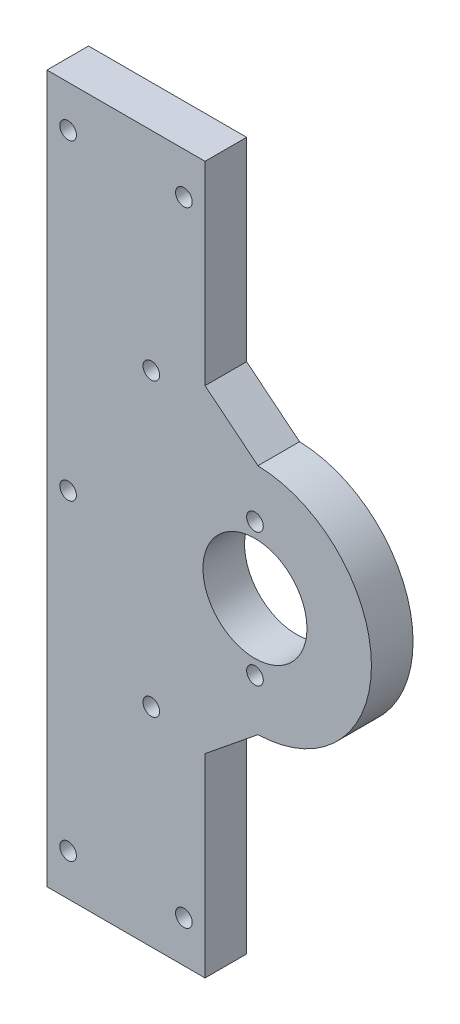
ISO-10303-21;
HEADER;
FILE_DESCRIPTION(('STEP AP214'),'2;1');
FILE_NAME('part.step','',(''),(''),'','','');
FILE_SCHEMA(('AUTOMOTIVE_DESIGN { 1 0 10303 214 1 1 1 1 }'));
ENDSEC;
DATA;
#1=APPLICATION_CONTEXT('core data for automotive mechanical design processes');
#2=APPLICATION_PROTOCOL_DEFINITION('international standard','automotive_design',2000,#1);
#3=PRODUCT_CONTEXT('',#1,'mechanical');
#4=PRODUCT('Part','Part','',(#3));
#5=PRODUCT_RELATED_PRODUCT_CATEGORY('part','',(#4));
#6=PRODUCT_DEFINITION_FORMATION('','',#4);
#7=PRODUCT_DEFINITION_CONTEXT('part definition',#1,'design');
#8=PRODUCT_DEFINITION('design','',#6,#7);
#9=PRODUCT_DEFINITION_SHAPE('','',#8);
#10=(LENGTH_UNIT() NAMED_UNIT(*) SI_UNIT(.MILLI.,.METRE.));
#11=(NAMED_UNIT(*) PLANE_ANGLE_UNIT() SI_UNIT($,.RADIAN.));
#12=(NAMED_UNIT(*) SI_UNIT($,.STERADIAN.) SOLID_ANGLE_UNIT());
#13=UNCERTAINTY_MEASURE_WITH_UNIT(LENGTH_MEASURE(1.E-05),#10,'distance_accuracy_value','');
#14=(GEOMETRIC_REPRESENTATION_CONTEXT(3) GLOBAL_UNCERTAINTY_ASSIGNED_CONTEXT((#13)) GLOBAL_UNIT_ASSIGNED_CONTEXT((#10,
#11,#12)) REPRESENTATION_CONTEXT('',''));
#15=CARTESIAN_POINT('',(0.,0.,0.));
#16=DIRECTION('',(0.,0.,1.));
#17=DIRECTION('',(1.,0.,0.));
#18=AXIS2_PLACEMENT_3D('',#15,#16,#17);
#19=CARTESIAN_POINT('',(11.0000287241917,0.000305589545769956,10.));
#20=DIRECTION('',(0.,0.,1.));
#21=DIRECTION('',(1.,0.,0.));
#22=AXIS2_PLACEMENT_3D('',#19,#20,#21);
#23=PLANE('',#22);
#24=CARTESIAN_POINT('',(11.0000287241921,16.0003055895463,10.));
#25=DIRECTION('',(0.,0.,1.));
#26=DIRECTION('',(1.,0.,0.));
#27=AXIS2_PLACEMENT_3D('',#24,#25,#26);
#28=CIRCLE('',#27,2.);
#29=CARTESIAN_POINT('',(13.0000287241921,16.0003055895463,10.));
#30=VERTEX_POINT('',#29);
#31=EDGE_CURVE('E224',#30,#30,#28,.T.);
#32=ORIENTED_EDGE('',*,*,#31,.F.);
#33=EDGE_LOOP('',(#32));
#34=FACE_BOUND('',#33,.T.);
#35=CARTESIAN_POINT('',(-33.9162598292717,0.,10.));
#36=DIRECTION('',(0.,0.,1.));
#37=DIRECTION('',(1.,0.,0.));
#38=AXIS2_PLACEMENT_3D('',#35,#36,#37);
#39=CIRCLE('',#38,2.);
#40=CARTESIAN_POINT('',(-31.9162598292717,0.,10.));
#41=VERTEX_POINT('',#40);
#42=EDGE_CURVE('E212',#41,#41,#39,.T.);
#43=ORIENTED_EDGE('',*,*,#42,.F.);
#44=EDGE_LOOP('',(#43));
#45=FACE_BOUND('',#44,.T.);
#46=CARTESIAN_POINT('',(-6.08379761911191,-75.,10.));
#47=DIRECTION('',(0.,0.,1.));
#48=DIRECTION('',(1.,0.,0.));
#49=AXIS2_PLACEMENT_3D('',#46,#47,#48);
#50=CIRCLE('',#49,2.);
#51=CARTESIAN_POINT('',(-4.08379761911191,-75.,10.));
#52=VERTEX_POINT('',#51);
#53=EDGE_CURVE('E200',#52,#52,#50,.T.);
#54=ORIENTED_EDGE('',*,*,#53,.F.);
#55=EDGE_LOOP('',(#54));
#56=FACE_BOUND('',#55,.T.);
#57=CARTESIAN_POINT('',(11.0000287241917,0.000305589545769956,10.));
#58=DIRECTION('',(0.,0.,1.));
#59=DIRECTION('',(1.,0.,0.));
#60=AXIS2_PLACEMENT_3D('',#57,#58,#59);
#61=CIRCLE('',#60,12.5);
#62=CARTESIAN_POINT('',(23.5000287241917,0.000305589545769956,10.));
#63=VERTEX_POINT('',#62);
#64=EDGE_CURVE('E188',#63,#63,#61,.T.);
#65=ORIENTED_EDGE('',*,*,#64,.F.);
#66=EDGE_LOOP('',(#65));
#67=FACE_BOUND('',#66,.T.);
#68=CARTESIAN_POINT('',(-13.9162598292717,-35.,10.));
#69=DIRECTION('',(0.,0.,1.));
#70=DIRECTION('',(1.,0.,0.));
#71=AXIS2_PLACEMENT_3D('',#68,#69,#70);
#72=CIRCLE('',#71,2.);
#73=CARTESIAN_POINT('',(-11.9162598292717,-35.,10.));
#74=VERTEX_POINT('',#73);
#75=EDGE_CURVE('E134',#74,#74,#72,.T.);
#76=ORIENTED_EDGE('',*,*,#75,.F.);
#77=EDGE_LOOP('',(#76));
#78=FACE_BOUND('',#77,.T.);
#79=DIRECTION('',(0.,1.,0.));
#80=VECTOR('',#79,1.);
#81=CARTESIAN_POINT('',(-1.00002872419179,-85.,10.));
#82=LINE('',#81,#80);
#83=CARTESIAN_POINT('',(-1.00002872419179,-85.,10.));
#84=VERTEX_POINT('',#83);
#85=CARTESIAN_POINT('',(-1.00002872419179,-38.2978884415605,10.));
#86=VERTEX_POINT('',#85);
#87=EDGE_CURVE('E145',#84,#86,#82,.T.);
#88=ORIENTED_EDGE('',*,*,#87,.T.);
#89=DIRECTION('',(0.776892174709221,0.629633662438387,0.));
#90=VECTOR('',#89,1.);
#91=CARTESIAN_POINT('',(-1.00002872419179,-38.2978884415605,10.));
#92=LINE('',#91,#90);
#93=CARTESIAN_POINT('',(11.7180653731377,-27.9904861707952,10.));
#94=VERTEX_POINT('',#93);
#95=EDGE_CURVE('E93',#86,#94,#92,.T.);
#96=ORIENTED_EDGE('',*,*,#95,.T.);
#97=CARTESIAN_POINT('',(11.0000287241917,0.000305589545769956,10.));
#98=DIRECTION('',(0.,0.,1.));
#99=DIRECTION('',(1.,0.,0.));
#100=AXIS2_PLACEMENT_3D('',#97,#98,#99);
#101=CIRCLE('',#100,28.);
#102=CARTESIAN_POINT('',(11.7180653731377,27.9910973498867,10.));
#103=VERTEX_POINT('',#102);
#104=EDGE_CURVE('E160',#94,#103,#101,.T.);
#105=ORIENTED_EDGE('',*,*,#104,.T.);
#106=DIRECTION('',(-0.776892174709221,0.629633662438387,0.));
#107=VECTOR('',#106,1.);
#108=CARTESIAN_POINT('',(11.7180653731377,27.9910973498867,10.));
#109=LINE('',#108,#107);
#110=CARTESIAN_POINT('',(-1.00002872419179,38.298499620652,10.));
#111=VERTEX_POINT('',#110);
#112=EDGE_CURVE('E173',#103,#111,#109,.T.);
#113=ORIENTED_EDGE('',*,*,#112,.T.);
#114=DIRECTION('',(0.,1.,0.));
#115=VECTOR('',#114,1.);
#116=CARTESIAN_POINT('',(-1.00002872419179,38.298499620652,10.));
#117=LINE('',#116,#115);
#118=CARTESIAN_POINT('',(-1.00002872419179,85.,10.));
#119=VERTEX_POINT('',#118);
#120=EDGE_CURVE('E112',#111,#119,#117,.T.);
#121=ORIENTED_EDGE('',*,*,#120,.T.);
#122=DIRECTION('',(-1.,0.,0.));
#123=VECTOR('',#122,1.);
#124=CARTESIAN_POINT('',(-1.00002872419179,85.,10.));
#125=LINE('',#124,#123);
#126=CARTESIAN_POINT('',(-39.0000287241918,85.,10.));
#127=VERTEX_POINT('',#126);
#128=EDGE_CURVE('E106',#119,#127,#125,.T.);
#129=ORIENTED_EDGE('',*,*,#128,.T.);
#130=DIRECTION('',(0.,-1.,0.));
#131=VECTOR('',#130,1.);
#132=CARTESIAN_POINT('',(-39.0000287241918,85.,10.));
#133=LINE('',#132,#131);
#134=CARTESIAN_POINT('',(-39.0000287241918,-85.,10.));
#135=VERTEX_POINT('',#134);
#136=EDGE_CURVE('E110',#127,#135,#133,.T.);
#137=ORIENTED_EDGE('',*,*,#136,.T.);
#138=DIRECTION('',(1.,0.,0.));
#139=VECTOR('',#138,1.);
#140=CARTESIAN_POINT('',(-39.0000287241918,-85.,10.));
#141=LINE('',#140,#139);
#142=EDGE_CURVE('E50',#135,#84,#141,.T.);
#143=ORIENTED_EDGE('',*,*,#142,.T.);
#144=EDGE_LOOP('',(#88,#96,#105,#113,#121,#129,#137,#143));
#145=FACE_BOUND('',#144,.T.);
#146=CARTESIAN_POINT('',(-13.9162598292717,35.,10.));
#147=DIRECTION('',(0.,0.,1.));
#148=DIRECTION('',(1.,0.,0.));
#149=AXIS2_PLACEMENT_3D('',#146,#147,#148);
#150=CIRCLE('',#149,2.);
#151=CARTESIAN_POINT('',(-11.9162598292717,35.,10.));
#152=VERTEX_POINT('',#151);
#153=EDGE_CURVE('E182',#152,#152,#150,.T.);
#154=ORIENTED_EDGE('',*,*,#153,.F.);
#155=EDGE_LOOP('',(#154));
#156=FACE_BOUND('',#155,.T.);
#157=CARTESIAN_POINT('',(-6.08379761911191,75.,10.));
#158=DIRECTION('',(0.,0.,1.));
#159=DIRECTION('',(1.,0.,0.));
#160=AXIS2_PLACEMENT_3D('',#157,#158,#159);
#161=CIRCLE('',#160,2.);
#162=CARTESIAN_POINT('',(-4.08379761911191,75.,10.));
#163=VERTEX_POINT('',#162);
#164=EDGE_CURVE('E194',#163,#163,#161,.T.);
#165=ORIENTED_EDGE('',*,*,#164,.F.);
#166=EDGE_LOOP('',(#165));
#167=FACE_BOUND('',#166,.T.);
#168=CARTESIAN_POINT('',(-33.9162598292717,75.,10.));
#169=DIRECTION('',(0.,0.,1.));
#170=DIRECTION('',(1.,0.,0.));
#171=AXIS2_PLACEMENT_3D('',#168,#169,#170);
#172=CIRCLE('',#171,2.00000000000001);
#173=CARTESIAN_POINT('',(-31.9162598292717,75.,10.));
#174=VERTEX_POINT('',#173);
#175=EDGE_CURVE('E206',#174,#174,#172,.T.);
#176=ORIENTED_EDGE('',*,*,#175,.F.);
#177=EDGE_LOOP('',(#176));
#178=FACE_BOUND('',#177,.T.);
#179=CARTESIAN_POINT('',(11.0000287241921,-15.9996944104537,10.));
#180=DIRECTION('',(0.,0.,1.));
#181=DIRECTION('',(1.,0.,0.));
#182=AXIS2_PLACEMENT_3D('',#179,#180,#181);
#183=CIRCLE('',#182,2.);
#184=CARTESIAN_POINT('',(13.0000287241921,-15.9996944104537,10.));
#185=VERTEX_POINT('',#184);
#186=EDGE_CURVE('E218',#185,#185,#183,.T.);
#187=ORIENTED_EDGE('',*,*,#186,.F.);
#188=EDGE_LOOP('',(#187));
#189=FACE_BOUND('',#188,.T.);
#190=CARTESIAN_POINT('',(-33.9162598292717,-75.,10.));
#191=DIRECTION('',(0.,0.,1.));
#192=DIRECTION('',(1.,0.,0.));
#193=AXIS2_PLACEMENT_3D('',#190,#191,#192);
#194=CIRCLE('',#193,2.00000000000001);
#195=CARTESIAN_POINT('',(-31.9162598292717,-75.,10.));
#196=VERTEX_POINT('',#195);
#197=EDGE_CURVE('E230',#196,#196,#194,.T.);
#198=ORIENTED_EDGE('',*,*,#197,.F.);
#199=EDGE_LOOP('',(#198));
#200=FACE_BOUND('',#199,.T.);
#201=ADVANCED_FACE('F33',(#34,#45,#56,#67,#78,#145,#156,#167,#178,#189,#200),#23,.T.);
#202=CARTESIAN_POINT('',(11.0000287241917,0.000305589545769956,0.));
#203=DIRECTION('',(0.,0.,1.));
#204=DIRECTION('',(1.,0.,0.));
#205=AXIS2_PLACEMENT_3D('',#202,#203,#204);
#206=PLANE('',#205);
#207=DIRECTION('',(0.,1.,0.));
#208=VECTOR('',#207,1.);
#209=CARTESIAN_POINT('',(-1.00002872419179,-85.,0.));
#210=LINE('',#209,#208);
#211=CARTESIAN_POINT('',(-1.00002872419179,-85.,0.));
#212=VERTEX_POINT('',#211);
#213=CARTESIAN_POINT('',(-1.00002872419179,-38.2978884415605,0.));
#214=VERTEX_POINT('',#213);
#215=EDGE_CURVE('E130',#212,#214,#210,.T.);
#216=ORIENTED_EDGE('',*,*,#215,.F.);
#217=DIRECTION('',(1.,0.,0.));
#218=VECTOR('',#217,1.);
#219=CARTESIAN_POINT('',(-39.0000287241918,-85.,0.));
#220=LINE('',#219,#218);
#221=CARTESIAN_POINT('',(-39.0000287241918,-85.,0.));
#222=VERTEX_POINT('',#221);
#223=EDGE_CURVE('E85',#222,#212,#220,.T.);
#224=ORIENTED_EDGE('',*,*,#223,.F.);
#225=DIRECTION('',(0.,-1.,0.));
#226=VECTOR('',#225,1.);
#227=CARTESIAN_POINT('',(-39.0000287241918,85.,0.));
#228=LINE('',#227,#226);
#229=CARTESIAN_POINT('',(-39.0000287241918,85.,0.));
#230=VERTEX_POINT('',#229);
#231=EDGE_CURVE('E79',#230,#222,#228,.T.);
#232=ORIENTED_EDGE('',*,*,#231,.F.);
#233=DIRECTION('',(-1.,0.,0.));
#234=VECTOR('',#233,1.);
#235=CARTESIAN_POINT('',(-1.00002872419179,85.,0.));
#236=LINE('',#235,#234);
#237=CARTESIAN_POINT('',(-1.00002872419179,85.,0.));
#238=VERTEX_POINT('',#237);
#239=EDGE_CURVE('E120',#238,#230,#236,.T.);
#240=ORIENTED_EDGE('',*,*,#239,.F.);
#241=DIRECTION('',(0.,1.,0.));
#242=VECTOR('',#241,1.);
#243=CARTESIAN_POINT('',(-1.00002872419179,38.298499620652,0.));
#244=LINE('',#243,#242);
#245=CARTESIAN_POINT('',(-1.00002872419179,38.298499620652,0.));
#246=VERTEX_POINT('',#245);
#247=EDGE_CURVE('E140',#246,#238,#244,.T.);
#248=ORIENTED_EDGE('',*,*,#247,.F.);
#249=DIRECTION('',(-0.776892174709221,0.629633662438387,0.));
#250=VECTOR('',#249,1.);
#251=CARTESIAN_POINT('',(11.7180653731377,27.9910973498867,0.));
#252=LINE('',#251,#250);
#253=CARTESIAN_POINT('',(11.7180653731377,27.9910973498867,0.));
#254=VERTEX_POINT('',#253);
#255=EDGE_CURVE('E138',#254,#246,#252,.T.);
#256=ORIENTED_EDGE('',*,*,#255,.F.);
#257=CARTESIAN_POINT('',(11.0000287241917,0.000305589545769956,0.));
#258=DIRECTION('',(0.,0.,1.));
#259=DIRECTION('',(1.,0.,0.));
#260=AXIS2_PLACEMENT_3D('',#257,#258,#259);
#261=CIRCLE('',#260,28.);
#262=CARTESIAN_POINT('',(11.7180653731377,-27.9904861707952,0.));
#263=VERTEX_POINT('',#262);
#264=EDGE_CURVE('E136',#263,#254,#261,.T.);
#265=ORIENTED_EDGE('',*,*,#264,.F.);
#266=DIRECTION('',(0.776892174709221,0.629633662438387,0.));
#267=VECTOR('',#266,1.);
#268=CARTESIAN_POINT('',(-1.00002872419179,-38.2978884415605,0.));
#269=LINE('',#268,#267);
#270=EDGE_CURVE('E133',#214,#263,#269,.T.);
#271=ORIENTED_EDGE('',*,*,#270,.F.);
#272=EDGE_LOOP('',(#216,#224,#232,#240,#248,#256,#265,#271));
#273=FACE_BOUND('',#272,.T.);
#274=CARTESIAN_POINT('',(-13.9162598292717,-35.,0.));
#275=DIRECTION('',(0.,0.,1.));
#276=DIRECTION('',(1.,0.,0.));
#277=AXIS2_PLACEMENT_3D('',#274,#275,#276);
#278=CIRCLE('',#277,2.);
#279=CARTESIAN_POINT('',(-11.9162598292717,-35.,0.));
#280=VERTEX_POINT('',#279);
#281=EDGE_CURVE('E179',#280,#280,#278,.T.);
#282=ORIENTED_EDGE('',*,*,#281,.T.);
#283=EDGE_LOOP('',(#282));
#284=FACE_BOUND('',#283,.T.);
#285=CARTESIAN_POINT('',(-13.9162598292717,35.,0.));
#286=DIRECTION('',(0.,0.,1.));
#287=DIRECTION('',(1.,0.,0.));
#288=AXIS2_PLACEMENT_3D('',#285,#286,#287);
#289=CIRCLE('',#288,2.);
#290=CARTESIAN_POINT('',(-11.9162598292717,35.,0.));
#291=VERTEX_POINT('',#290);
#292=EDGE_CURVE('E185',#291,#291,#289,.T.);
#293=ORIENTED_EDGE('',*,*,#292,.T.);
#294=EDGE_LOOP('',(#293));
#295=FACE_BOUND('',#294,.T.);
#296=CARTESIAN_POINT('',(11.0000287241917,0.000305589545769956,0.));
#297=DIRECTION('',(0.,0.,1.));
#298=DIRECTION('',(1.,0.,0.));
#299=AXIS2_PLACEMENT_3D('',#296,#297,#298);
#300=CIRCLE('',#299,12.5);
#301=CARTESIAN_POINT('',(23.5000287241917,0.000305589545769956,0.));
#302=VERTEX_POINT('',#301);
#303=EDGE_CURVE('E191',#302,#302,#300,.T.);
#304=ORIENTED_EDGE('',*,*,#303,.T.);
#305=EDGE_LOOP('',(#304));
#306=FACE_BOUND('',#305,.T.);
#307=CARTESIAN_POINT('',(-6.08379761911191,75.,0.));
#308=DIRECTION('',(0.,0.,1.));
#309=DIRECTION('',(1.,0.,0.));
#310=AXIS2_PLACEMENT_3D('',#307,#308,#309);
#311=CIRCLE('',#310,2.);
#312=CARTESIAN_POINT('',(-4.08379761911191,75.,0.));
#313=VERTEX_POINT('',#312);
#314=EDGE_CURVE('E197',#313,#313,#311,.T.);
#315=ORIENTED_EDGE('',*,*,#314,.T.);
#316=EDGE_LOOP('',(#315));
#317=FACE_BOUND('',#316,.T.);
#318=CARTESIAN_POINT('',(-6.08379761911191,-75.,0.));
#319=DIRECTION('',(0.,0.,1.));
#320=DIRECTION('',(1.,0.,0.));
#321=AXIS2_PLACEMENT_3D('',#318,#319,#320);
#322=CIRCLE('',#321,2.);
#323=CARTESIAN_POINT('',(-4.08379761911191,-75.,0.));
#324=VERTEX_POINT('',#323);
#325=EDGE_CURVE('E203',#324,#324,#322,.T.);
#326=ORIENTED_EDGE('',*,*,#325,.T.);
#327=EDGE_LOOP('',(#326));
#328=FACE_BOUND('',#327,.T.);
#329=CARTESIAN_POINT('',(-33.9162598292717,75.,0.));
#330=DIRECTION('',(0.,0.,1.));
#331=DIRECTION('',(1.,0.,0.));
#332=AXIS2_PLACEMENT_3D('',#329,#330,#331);
#333=CIRCLE('',#332,2.00000000000001);
#334=CARTESIAN_POINT('',(-31.9162598292717,75.,0.));
#335=VERTEX_POINT('',#334);
#336=EDGE_CURVE('E209',#335,#335,#333,.T.);
#337=ORIENTED_EDGE('',*,*,#336,.T.);
#338=EDGE_LOOP('',(#337));
#339=FACE_BOUND('',#338,.T.);
#340=CARTESIAN_POINT('',(-33.9162598292717,0.,0.));
#341=DIRECTION('',(0.,0.,1.));
#342=DIRECTION('',(1.,0.,0.));
#343=AXIS2_PLACEMENT_3D('',#340,#341,#342);
#344=CIRCLE('',#343,2.);
#345=CARTESIAN_POINT('',(-31.9162598292717,0.,0.));
#346=VERTEX_POINT('',#345);
#347=EDGE_CURVE('E215',#346,#346,#344,.T.);
#348=ORIENTED_EDGE('',*,*,#347,.T.);
#349=EDGE_LOOP('',(#348));
#350=FACE_BOUND('',#349,.T.);
#351=CARTESIAN_POINT('',(11.0000287241921,-15.9996944104537,0.));
#352=DIRECTION('',(0.,0.,1.));
#353=DIRECTION('',(1.,0.,0.));
#354=AXIS2_PLACEMENT_3D('',#351,#352,#353);
#355=CIRCLE('',#354,2.);
#356=CARTESIAN_POINT('',(13.0000287241921,-15.9996944104537,0.));
#357=VERTEX_POINT('',#356);
#358=EDGE_CURVE('E221',#357,#357,#355,.T.);
#359=ORIENTED_EDGE('',*,*,#358,.T.);
#360=EDGE_LOOP('',(#359));
#361=FACE_BOUND('',#360,.T.);
#362=CARTESIAN_POINT('',(11.0000287241921,16.0003055895463,0.));
#363=DIRECTION('',(0.,0.,1.));
#364=DIRECTION('',(1.,0.,0.));
#365=AXIS2_PLACEMENT_3D('',#362,#363,#364);
#366=CIRCLE('',#365,2.);
#367=CARTESIAN_POINT('',(13.0000287241921,16.0003055895463,0.));
#368=VERTEX_POINT('',#367);
#369=EDGE_CURVE('E227',#368,#368,#366,.T.);
#370=ORIENTED_EDGE('',*,*,#369,.T.);
#371=EDGE_LOOP('',(#370));
#372=FACE_BOUND('',#371,.T.);
#373=CARTESIAN_POINT('',(-33.9162598292717,-75.,0.));
#374=DIRECTION('',(0.,0.,1.));
#375=DIRECTION('',(1.,0.,0.));
#376=AXIS2_PLACEMENT_3D('',#373,#374,#375);
#377=CIRCLE('',#376,2.00000000000001);
#378=CARTESIAN_POINT('',(-31.9162598292717,-75.,0.));
#379=VERTEX_POINT('',#378);
#380=EDGE_CURVE('E233',#379,#379,#377,.T.);
#381=ORIENTED_EDGE('',*,*,#380,.T.);
#382=EDGE_LOOP('',(#381));
#383=FACE_BOUND('',#382,.T.);
#384=ADVANCED_FACE('F164',(#273,#284,#295,#306,#317,#328,#339,#350,#361,#372,#383),#206,.F.);
#385=CARTESIAN_POINT('',(-1.00002872419179,-85.,10.));
#386=DIRECTION('',(-1.,0.,0.));
#387=DIRECTION('',(0.,0.,1.));
#388=AXIS2_PLACEMENT_3D('',#385,#386,#387);
#389=PLANE('',#388);
#390=ORIENTED_EDGE('',*,*,#215,.T.);
#391=DIRECTION('',(0.,0.,-1.));
#392=VECTOR('',#391,1.);
#393=CARTESIAN_POINT('',(-1.00002872419179,-38.2978884415605,10.));
#394=LINE('',#393,#392);
#395=EDGE_CURVE('E11',#86,#214,#394,.T.);
#396=ORIENTED_EDGE('',*,*,#395,.F.);
#397=ORIENTED_EDGE('',*,*,#87,.F.);
#398=DIRECTION('',(0.,0.,-1.));
#399=VECTOR('',#398,1.);
#400=CARTESIAN_POINT('',(-1.00002872419179,-85.,10.));
#401=LINE('',#400,#399);
#402=EDGE_CURVE('E126',#84,#212,#401,.T.);
#403=ORIENTED_EDGE('',*,*,#402,.T.);
#404=EDGE_LOOP('',(#390,#396,#397,#403));
#405=FACE_BOUND('',#404,.T.);
#406=ADVANCED_FACE('F35',(#405),#389,.F.);
#407=CARTESIAN_POINT('',(-1.00002872419179,-38.2978884415605,10.));
#408=DIRECTION('',(-0.629633662438387,0.776892174709221,0.));
#409=DIRECTION('',(-0.776892174709221,-0.629633662438387,0.));
#410=AXIS2_PLACEMENT_3D('',#407,#408,#409);
#411=PLANE('',#410);
#412=ORIENTED_EDGE('',*,*,#270,.T.);
#413=DIRECTION('',(0.,0.,-1.));
#414=VECTOR('',#413,1.);
#415=CARTESIAN_POINT('',(11.7180653731377,-27.9904861707952,10.));
#416=LINE('',#415,#414);
#417=EDGE_CURVE('E42',#94,#263,#416,.T.);
#418=ORIENTED_EDGE('',*,*,#417,.F.);
#419=ORIENTED_EDGE('',*,*,#95,.F.);
#420=ORIENTED_EDGE('',*,*,#395,.T.);
#421=EDGE_LOOP('',(#412,#418,#419,#420));
#422=FACE_BOUND('',#421,.T.);
#423=ADVANCED_FACE('F267',(#422),#411,.F.);
#424=CARTESIAN_POINT('',(11.0000287241917,0.000305589545769956,10.));
#425=DIRECTION('',(0.,0.,-1.));
#426=DIRECTION('',(-1.,0.,0.));
#427=AXIS2_PLACEMENT_3D('',#424,#425,#426);
#428=CYLINDRICAL_SURFACE('',#427,28.);
#429=ORIENTED_EDGE('',*,*,#264,.T.);
#430=DIRECTION('',(0.,0.,-1.));
#431=VECTOR('',#430,1.);
#432=CARTESIAN_POINT('',(11.7180653731377,27.9910973498867,10.));
#433=LINE('',#432,#431);
#434=EDGE_CURVE('E152',#103,#254,#433,.T.);
#435=ORIENTED_EDGE('',*,*,#434,.F.);
#436=ORIENTED_EDGE('',*,*,#104,.F.);
#437=ORIENTED_EDGE('',*,*,#417,.T.);
#438=EDGE_LOOP('',(#429,#435,#436,#437));
#439=FACE_BOUND('',#438,.T.);
#440=ADVANCED_FACE('F158',(#439),#428,.T.);
#441=CARTESIAN_POINT('',(11.7180653731377,27.9910973498867,10.));
#442=DIRECTION('',(-0.629633662438387,-0.776892174709221,0.));
#443=DIRECTION('',(0.776892174709222,-0.629633662438387,0.));
#444=AXIS2_PLACEMENT_3D('',#441,#442,#443);
#445=PLANE('',#444);
#446=ORIENTED_EDGE('',*,*,#255,.T.);
#447=DIRECTION('',(0.,0.,-1.));
#448=VECTOR('',#447,1.);
#449=CARTESIAN_POINT('',(-1.00002872419179,38.298499620652,10.));
#450=LINE('',#449,#448);
#451=EDGE_CURVE('E149',#111,#246,#450,.T.);
#452=ORIENTED_EDGE('',*,*,#451,.F.);
#453=ORIENTED_EDGE('',*,*,#112,.F.);
#454=ORIENTED_EDGE('',*,*,#434,.T.);
#455=EDGE_LOOP('',(#446,#452,#453,#454));
#456=FACE_BOUND('',#455,.T.);
#457=ADVANCED_FACE('F169',(#456),#445,.F.);
#458=CARTESIAN_POINT('',(-1.00002872419179,38.298499620652,10.));
#459=DIRECTION('',(-1.,0.,0.));
#460=DIRECTION('',(0.,0.,1.));
#461=AXIS2_PLACEMENT_3D('',#458,#459,#460);
#462=PLANE('',#461);
#463=ORIENTED_EDGE('',*,*,#247,.T.);
#464=DIRECTION('',(0.,0.,-1.));
#465=VECTOR('',#464,1.);
#466=CARTESIAN_POINT('',(-1.00002872419179,85.,10.));
#467=LINE('',#466,#465);
#468=EDGE_CURVE('E121',#119,#238,#467,.T.);
#469=ORIENTED_EDGE('',*,*,#468,.F.);
#470=ORIENTED_EDGE('',*,*,#120,.F.);
#471=ORIENTED_EDGE('',*,*,#451,.T.);
#472=EDGE_LOOP('',(#463,#469,#470,#471));
#473=FACE_BOUND('',#472,.T.);
#474=ADVANCED_FACE('F172',(#473),#462,.F.);
#475=CARTESIAN_POINT('',(-1.00002872419179,85.,10.));
#476=DIRECTION('',(0.,-1.,0.));
#477=DIRECTION('',(0.,0.,-1.));
#478=AXIS2_PLACEMENT_3D('',#475,#476,#477);
#479=PLANE('',#478);
#480=ORIENTED_EDGE('',*,*,#239,.T.);
#481=DIRECTION('',(0.,0.,-1.));
#482=VECTOR('',#481,1.);
#483=CARTESIAN_POINT('',(-39.0000287241918,85.,10.));
#484=LINE('',#483,#482);
#485=EDGE_CURVE('E117',#127,#230,#484,.T.);
#486=ORIENTED_EDGE('',*,*,#485,.F.);
#487=ORIENTED_EDGE('',*,*,#128,.F.);
#488=ORIENTED_EDGE('',*,*,#468,.T.);
#489=EDGE_LOOP('',(#480,#486,#487,#488));
#490=FACE_BOUND('',#489,.T.);
#491=ADVANCED_FACE('F118',(#490),#479,.F.);
#492=CARTESIAN_POINT('',(-39.0000287241918,85.,10.));
#493=DIRECTION('',(1.,0.,0.));
#494=DIRECTION('',(0.,0.,-1.));
#495=AXIS2_PLACEMENT_3D('',#492,#493,#494);
#496=PLANE('',#495);
#497=ORIENTED_EDGE('',*,*,#231,.T.);
#498=DIRECTION('',(0.,0.,-1.));
#499=VECTOR('',#498,1.);
#500=CARTESIAN_POINT('',(-39.0000287241918,-85.,10.));
#501=LINE('',#500,#499);
#502=EDGE_CURVE('E122',#135,#222,#501,.T.);
#503=ORIENTED_EDGE('',*,*,#502,.F.);
#504=ORIENTED_EDGE('',*,*,#136,.F.);
#505=ORIENTED_EDGE('',*,*,#485,.T.);
#506=EDGE_LOOP('',(#497,#503,#504,#505));
#507=FACE_BOUND('',#506,.T.);
#508=ADVANCED_FACE('F124',(#507),#496,.F.);
#509=CARTESIAN_POINT('',(-39.0000287241918,-85.,10.));
#510=DIRECTION('',(0.,1.,0.));
#511=DIRECTION('',(0.,0.,1.));
#512=AXIS2_PLACEMENT_3D('',#509,#510,#511);
#513=PLANE('',#512);
#514=ORIENTED_EDGE('',*,*,#223,.T.);
#515=ORIENTED_EDGE('',*,*,#402,.F.);
#516=ORIENTED_EDGE('',*,*,#142,.F.);
#517=ORIENTED_EDGE('',*,*,#502,.T.);
#518=EDGE_LOOP('',(#514,#515,#516,#517));
#519=FACE_BOUND('',#518,.T.);
#520=ADVANCED_FACE('F255',(#519),#513,.F.);
#521=CARTESIAN_POINT('',(-13.9162598292717,-35.,10.));
#522=DIRECTION('',(0.,0.,-1.));
#523=DIRECTION('',(-1.,0.,0.));
#524=AXIS2_PLACEMENT_3D('',#521,#522,#523);
#525=CYLINDRICAL_SURFACE('',#524,2.);
#526=ORIENTED_EDGE('',*,*,#75,.T.);
#527=EDGE_LOOP('',(#526));
#528=FACE_BOUND('',#527,.T.);
#529=ORIENTED_EDGE('',*,*,#281,.F.);
#530=EDGE_LOOP('',(#529));
#531=FACE_BOUND('',#530,.T.);
#532=ADVANCED_FACE('F252',(#528,#531),#525,.F.);
#533=CARTESIAN_POINT('',(-13.9162598292717,35.,10.));
#534=DIRECTION('',(0.,0.,-1.));
#535=DIRECTION('',(-1.,0.,0.));
#536=AXIS2_PLACEMENT_3D('',#533,#534,#535);
#537=CYLINDRICAL_SURFACE('',#536,2.);
#538=ORIENTED_EDGE('',*,*,#153,.T.);
#539=EDGE_LOOP('',(#538));
#540=FACE_BOUND('',#539,.T.);
#541=ORIENTED_EDGE('',*,*,#292,.F.);
#542=EDGE_LOOP('',(#541));
#543=FACE_BOUND('',#542,.T.);
#544=ADVANCED_FACE('F331',(#540,#543),#537,.F.);
#545=CARTESIAN_POINT('',(11.0000287241917,0.000305589545769956,10.));
#546=DIRECTION('',(0.,0.,-1.));
#547=DIRECTION('',(-1.,0.,0.));
#548=AXIS2_PLACEMENT_3D('',#545,#546,#547);
#549=CYLINDRICAL_SURFACE('',#548,12.5);
#550=ORIENTED_EDGE('',*,*,#64,.T.);
#551=EDGE_LOOP('',(#550));
#552=FACE_BOUND('',#551,.T.);
#553=ORIENTED_EDGE('',*,*,#303,.F.);
#554=EDGE_LOOP('',(#553));
#555=FACE_BOUND('',#554,.T.);
#556=ADVANCED_FACE('F339',(#552,#555),#549,.F.);
#557=CARTESIAN_POINT('',(-6.08379761911191,75.,10.));
#558=DIRECTION('',(0.,0.,-1.));
#559=DIRECTION('',(-1.,0.,0.));
#560=AXIS2_PLACEMENT_3D('',#557,#558,#559);
#561=CYLINDRICAL_SURFACE('',#560,2.);
#562=ORIENTED_EDGE('',*,*,#164,.T.);
#563=EDGE_LOOP('',(#562));
#564=FACE_BOUND('',#563,.T.);
#565=ORIENTED_EDGE('',*,*,#314,.F.);
#566=EDGE_LOOP('',(#565));
#567=FACE_BOUND('',#566,.T.);
#568=ADVANCED_FACE('F347',(#564,#567),#561,.F.);
#569=CARTESIAN_POINT('',(-6.08379761911191,-75.,10.));
#570=DIRECTION('',(0.,0.,-1.));
#571=DIRECTION('',(-1.,0.,0.));
#572=AXIS2_PLACEMENT_3D('',#569,#570,#571);
#573=CYLINDRICAL_SURFACE('',#572,2.);
#574=ORIENTED_EDGE('',*,*,#53,.T.);
#575=EDGE_LOOP('',(#574));
#576=FACE_BOUND('',#575,.T.);
#577=ORIENTED_EDGE('',*,*,#325,.F.);
#578=EDGE_LOOP('',(#577));
#579=FACE_BOUND('',#578,.T.);
#580=ADVANCED_FACE('F356',(#576,#579),#573,.F.);
#581=CARTESIAN_POINT('',(-33.9162598292717,75.,10.));
#582=DIRECTION('',(0.,0.,-1.));
#583=DIRECTION('',(-1.,0.,0.));
#584=AXIS2_PLACEMENT_3D('',#581,#582,#583);
#585=CYLINDRICAL_SURFACE('',#584,2.00000000000001);
#586=ORIENTED_EDGE('',*,*,#175,.T.);
#587=EDGE_LOOP('',(#586));
#588=FACE_BOUND('',#587,.T.);
#589=ORIENTED_EDGE('',*,*,#336,.F.);
#590=EDGE_LOOP('',(#589));
#591=FACE_BOUND('',#590,.T.);
#592=ADVANCED_FACE('F365',(#588,#591),#585,.F.);
#593=CARTESIAN_POINT('',(-33.9162598292717,0.,10.));
#594=DIRECTION('',(0.,0.,-1.));
#595=DIRECTION('',(-1.,0.,0.));
#596=AXIS2_PLACEMENT_3D('',#593,#594,#595);
#597=CYLINDRICAL_SURFACE('',#596,2.);
#598=ORIENTED_EDGE('',*,*,#42,.T.);
#599=EDGE_LOOP('',(#598));
#600=FACE_BOUND('',#599,.T.);
#601=ORIENTED_EDGE('',*,*,#347,.F.);
#602=EDGE_LOOP('',(#601));
#603=FACE_BOUND('',#602,.T.);
#604=ADVANCED_FACE('F374',(#600,#603),#597,.F.);
#605=CARTESIAN_POINT('',(11.0000287241921,-15.9996944104537,10.));
#606=DIRECTION('',(0.,0.,-1.));
#607=DIRECTION('',(-1.,0.,0.));
#608=AXIS2_PLACEMENT_3D('',#605,#606,#607);
#609=CYLINDRICAL_SURFACE('',#608,2.);
#610=ORIENTED_EDGE('',*,*,#186,.T.);
#611=EDGE_LOOP('',(#610));
#612=FACE_BOUND('',#611,.T.);
#613=ORIENTED_EDGE('',*,*,#358,.F.);
#614=EDGE_LOOP('',(#613));
#615=FACE_BOUND('',#614,.T.);
#616=ADVANCED_FACE('F383',(#612,#615),#609,.F.);
#617=CARTESIAN_POINT('',(11.0000287241921,16.0003055895463,10.));
#618=DIRECTION('',(0.,0.,-1.));
#619=DIRECTION('',(-1.,0.,0.));
#620=AXIS2_PLACEMENT_3D('',#617,#618,#619);
#621=CYLINDRICAL_SURFACE('',#620,2.);
#622=ORIENTED_EDGE('',*,*,#31,.T.);
#623=EDGE_LOOP('',(#622));
#624=FACE_BOUND('',#623,.T.);
#625=ORIENTED_EDGE('',*,*,#369,.F.);
#626=EDGE_LOOP('',(#625));
#627=FACE_BOUND('',#626,.T.);
#628=ADVANCED_FACE('F392',(#624,#627),#621,.F.);
#629=CARTESIAN_POINT('',(-33.9162598292717,-75.,10.));
#630=DIRECTION('',(0.,0.,-1.));
#631=DIRECTION('',(-1.,0.,0.));
#632=AXIS2_PLACEMENT_3D('',#629,#630,#631);
#633=CYLINDRICAL_SURFACE('',#632,2.00000000000001);
#634=ORIENTED_EDGE('',*,*,#197,.T.);
#635=EDGE_LOOP('',(#634));
#636=FACE_BOUND('',#635,.T.);
#637=ORIENTED_EDGE('',*,*,#380,.F.);
#638=EDGE_LOOP('',(#637));
#639=FACE_BOUND('',#638,.T.);
#640=ADVANCED_FACE('F239',(#636,#639),#633,.F.);
#641=CLOSED_SHELL('',(#201,#384,#406,#423,#440,#457,#474,#491,#508,#520,#532,#544,#556,#568,
#580,#592,#604,#616,#628,#640));
#642=MANIFOLD_SOLID_BREP('B2',#641);
#643=ADVANCED_BREP_SHAPE_REPRESENTATION('',(#18,#642),#14);
#644=SHAPE_DEFINITION_REPRESENTATION(#9,#643);
ENDSEC;
END-ISO-10303-21;
